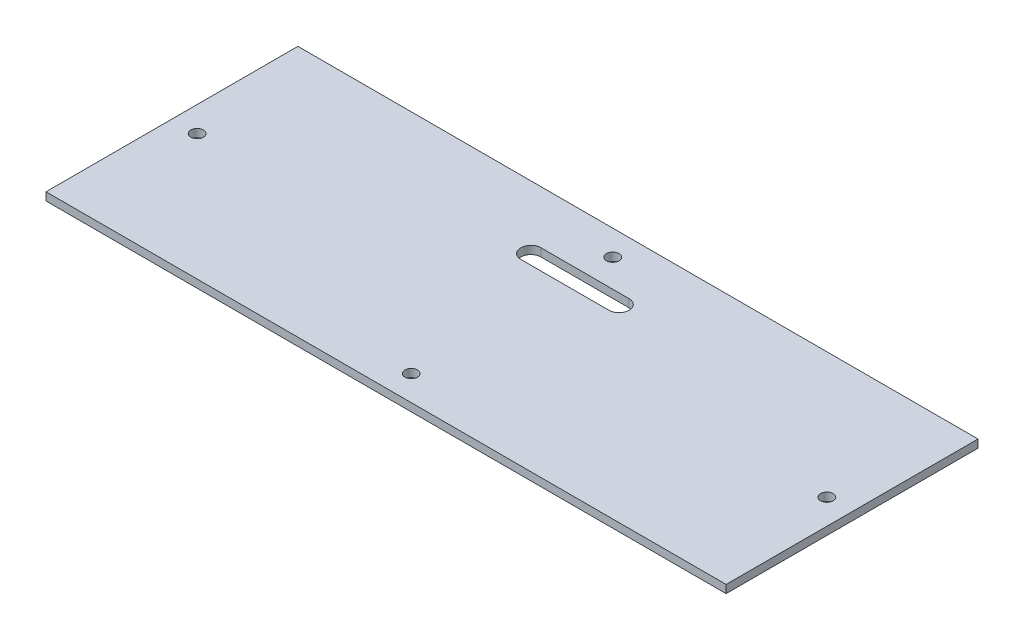
ISO-10303-21;
HEADER;
FILE_DESCRIPTION(('STEP AP214'),'2;1');
FILE_NAME('part.step','',(''),(''),'','','');
FILE_SCHEMA(('AUTOMOTIVE_DESIGN { 1 0 10303 214 1 1 1 1 }'));
ENDSEC;
DATA;
#1=APPLICATION_CONTEXT('core data for automotive mechanical design processes');
#2=APPLICATION_PROTOCOL_DEFINITION('international standard','automotive_design',2000,#1);
#3=PRODUCT_CONTEXT('',#1,'mechanical');
#4=PRODUCT('Part','Part','',(#3));
#5=PRODUCT_RELATED_PRODUCT_CATEGORY('part','',(#4));
#6=PRODUCT_DEFINITION_FORMATION('','',#4);
#7=PRODUCT_DEFINITION_CONTEXT('part definition',#1,'design');
#8=PRODUCT_DEFINITION('design','',#6,#7);
#9=PRODUCT_DEFINITION_SHAPE('','',#8);
#10=(LENGTH_UNIT() NAMED_UNIT(*) SI_UNIT(.MILLI.,.METRE.));
#11=(NAMED_UNIT(*) PLANE_ANGLE_UNIT() SI_UNIT($,.RADIAN.));
#12=(NAMED_UNIT(*) SI_UNIT($,.STERADIAN.) SOLID_ANGLE_UNIT());
#13=UNCERTAINTY_MEASURE_WITH_UNIT(LENGTH_MEASURE(1.E-05),#10,'distance_accuracy_value','');
#14=(GEOMETRIC_REPRESENTATION_CONTEXT(3) GLOBAL_UNCERTAINTY_ASSIGNED_CONTEXT((#13)) GLOBAL_UNIT_ASSIGNED_CONTEXT((#10,
#11,#12)) REPRESENTATION_CONTEXT('',''));
#15=CARTESIAN_POINT('',(0.,0.,0.));
#16=DIRECTION('',(0.,0.,1.));
#17=DIRECTION('',(1.,0.,0.));
#18=AXIS2_PLACEMENT_3D('',#15,#16,#17);
#19=CARTESIAN_POINT('',(0.,3.175,0.));
#20=DIRECTION('',(1.,0.,0.));
#21=DIRECTION('',(0.,0.,-1.));
#22=AXIS2_PLACEMENT_3D('',#19,#20,#21);
#23=PLANE('',#22);
#24=DIRECTION('',(0.,0.,1.));
#25=VECTOR('',#24,1.);
#26=CARTESIAN_POINT('',(0.,0.,0.));
#27=LINE('',#26,#25);
#28=CARTESIAN_POINT('',(0.,0.,-100.));
#29=VERTEX_POINT('',#28);
#30=CARTESIAN_POINT('',(0.,0.,0.));
#31=VERTEX_POINT('',#30);
#32=EDGE_CURVE('E134',#29,#31,#27,.T.);
#33=ORIENTED_EDGE('',*,*,#32,.T.);
#34=DIRECTION('',(0.,-1.,0.));
#35=VECTOR('',#34,1.);
#36=CARTESIAN_POINT('',(0.,3.175,0.));
#37=LINE('',#36,#35);
#38=CARTESIAN_POINT('',(0.,3.175,0.));
#39=VERTEX_POINT('',#38);
#40=EDGE_CURVE('E11',#39,#31,#37,.T.);
#41=ORIENTED_EDGE('',*,*,#40,.F.);
#42=DIRECTION('',(0.,0.,1.));
#43=VECTOR('',#42,1.);
#44=CARTESIAN_POINT('',(0.,3.175,0.));
#45=LINE('',#44,#43);
#46=CARTESIAN_POINT('',(0.,3.175,-100.));
#47=VERTEX_POINT('',#46);
#48=EDGE_CURVE('E140',#47,#39,#45,.T.);
#49=ORIENTED_EDGE('',*,*,#48,.F.);
#50=DIRECTION('',(0.,-1.,0.));
#51=VECTOR('',#50,1.);
#52=CARTESIAN_POINT('',(0.,3.175,-100.));
#53=LINE('',#52,#51);
#54=EDGE_CURVE('E126',#47,#29,#53,.T.);
#55=ORIENTED_EDGE('',*,*,#54,.T.);
#56=EDGE_LOOP('',(#33,#41,#49,#55));
#57=FACE_BOUND('',#56,.T.);
#58=ADVANCED_FACE('F33',(#57),#23,.F.);
#59=CARTESIAN_POINT('',(0.,3.175,0.));
#60=DIRECTION('',(0.,0.,-1.));
#61=DIRECTION('',(-1.,0.,0.));
#62=AXIS2_PLACEMENT_3D('',#59,#60,#61);
#63=PLANE('',#62);
#64=DIRECTION('',(1.,0.,0.));
#65=VECTOR('',#64,1.);
#66=CARTESIAN_POINT('',(0.,0.,0.));
#67=LINE('',#66,#65);
#68=CARTESIAN_POINT('',(270.,0.,0.));
#69=VERTEX_POINT('',#68);
#70=EDGE_CURVE('E88',#31,#69,#67,.T.);
#71=ORIENTED_EDGE('',*,*,#70,.T.);
#72=DIRECTION('',(0.,-1.,0.));
#73=VECTOR('',#72,1.);
#74=CARTESIAN_POINT('',(270.,3.175,0.));
#75=LINE('',#74,#73);
#76=CARTESIAN_POINT('',(270.,3.175,0.));
#77=VERTEX_POINT('',#76);
#78=EDGE_CURVE('E41',#77,#69,#75,.T.);
#79=ORIENTED_EDGE('',*,*,#78,.F.);
#80=DIRECTION('',(1.,0.,0.));
#81=VECTOR('',#80,1.);
#82=CARTESIAN_POINT('',(0.,3.175,0.));
#83=LINE('',#82,#81);
#84=EDGE_CURVE('E111',#39,#77,#83,.T.);
#85=ORIENTED_EDGE('',*,*,#84,.F.);
#86=ORIENTED_EDGE('',*,*,#40,.T.);
#87=EDGE_LOOP('',(#71,#79,#85,#86));
#88=FACE_BOUND('',#87,.T.);
#89=ADVANCED_FACE('F169',(#88),#63,.F.);
#90=CARTESIAN_POINT('',(270.,3.175,0.));
#91=DIRECTION('',(-1.,0.,0.));
#92=DIRECTION('',(0.,0.,1.));
#93=AXIS2_PLACEMENT_3D('',#90,#91,#92);
#94=PLANE('',#93);
#95=DIRECTION('',(0.,0.,-1.));
#96=VECTOR('',#95,1.);
#97=CARTESIAN_POINT('',(270.,0.,0.));
#98=LINE('',#97,#96);
#99=CARTESIAN_POINT('',(270.,0.,-100.));
#100=VERTEX_POINT('',#99);
#101=EDGE_CURVE('E96',#69,#100,#98,.T.);
#102=ORIENTED_EDGE('',*,*,#101,.T.);
#103=DIRECTION('',(0.,-1.,0.));
#104=VECTOR('',#103,1.);
#105=CARTESIAN_POINT('',(270.,3.175,-100.));
#106=LINE('',#105,#104);
#107=CARTESIAN_POINT('',(270.,3.175,-100.));
#108=VERTEX_POINT('',#107);
#109=EDGE_CURVE('E124',#108,#100,#106,.T.);
#110=ORIENTED_EDGE('',*,*,#109,.F.);
#111=DIRECTION('',(0.,0.,-1.));
#112=VECTOR('',#111,1.);
#113=CARTESIAN_POINT('',(270.,3.175,0.));
#114=LINE('',#113,#112);
#115=EDGE_CURVE('E119',#77,#108,#114,.T.);
#116=ORIENTED_EDGE('',*,*,#115,.F.);
#117=ORIENTED_EDGE('',*,*,#78,.T.);
#118=EDGE_LOOP('',(#102,#110,#116,#117));
#119=FACE_BOUND('',#118,.T.);
#120=ADVANCED_FACE('F125',(#119),#94,.F.);
#121=CARTESIAN_POINT('',(0.,3.175,-100.));
#122=DIRECTION('',(0.,0.,1.));
#123=DIRECTION('',(1.,0.,0.));
#124=AXIS2_PLACEMENT_3D('',#121,#122,#123);
#125=PLANE('',#124);
#126=DIRECTION('',(-1.,0.,0.));
#127=VECTOR('',#126,1.);
#128=CARTESIAN_POINT('',(0.,0.,-100.));
#129=LINE('',#128,#127);
#130=EDGE_CURVE('E103',#100,#29,#129,.T.);
#131=ORIENTED_EDGE('',*,*,#130,.T.);
#132=ORIENTED_EDGE('',*,*,#54,.F.);
#133=DIRECTION('',(-1.,0.,0.));
#134=VECTOR('',#133,1.);
#135=CARTESIAN_POINT('',(0.,3.175,-100.));
#136=LINE('',#135,#134);
#137=EDGE_CURVE('E122',#108,#47,#136,.T.);
#138=ORIENTED_EDGE('',*,*,#137,.F.);
#139=ORIENTED_EDGE('',*,*,#109,.T.);
#140=EDGE_LOOP('',(#131,#132,#138,#139));
#141=FACE_BOUND('',#140,.T.);
#142=ADVANCED_FACE('F128',(#141),#125,.F.);
#143=CARTESIAN_POINT('',(0.,3.175,0.));
#144=DIRECTION('',(0.,-1.,0.));
#145=DIRECTION('',(0.,0.,-1.));
#146=AXIS2_PLACEMENT_3D('',#143,#144,#145);
#147=PLANE('',#146);
#148=CARTESIAN_POINT('',(10.,3.175,-50.));
#149=DIRECTION('',(0.,-1.,0.));
#150=DIRECTION('',(0.,0.,-1.));
#151=AXIS2_PLACEMENT_3D('',#148,#149,#150);
#152=CIRCLE('',#151,2.5);
#153=CARTESIAN_POINT('',(10.,3.175,-52.5));
#154=VERTEX_POINT('',#153);
#155=EDGE_CURVE('E137',#154,#154,#152,.T.);
#156=ORIENTED_EDGE('',*,*,#155,.T.);
#157=EDGE_LOOP('',(#156));
#158=FACE_BOUND('',#157,.T.);
#159=CARTESIAN_POINT('',(260.,3.175,-50.));
#160=DIRECTION('',(0.,-1.,0.));
#161=DIRECTION('',(0.,0.,-1.));
#162=AXIS2_PLACEMENT_3D('',#159,#160,#161);
#163=CIRCLE('',#162,2.50000000000002);
#164=CARTESIAN_POINT('',(260.,3.175,-52.5));
#165=VERTEX_POINT('',#164);
#166=EDGE_CURVE('E157',#165,#165,#163,.T.);
#167=ORIENTED_EDGE('',*,*,#166,.T.);
#168=EDGE_LOOP('',(#167));
#169=FACE_BOUND('',#168,.T.);
#170=CARTESIAN_POINT('',(135.,3.175,-90.));
#171=DIRECTION('',(0.,-1.,0.));
#172=DIRECTION('',(0.,0.,-1.));
#173=AXIS2_PLACEMENT_3D('',#170,#171,#172);
#174=CIRCLE('',#173,2.5);
#175=CARTESIAN_POINT('',(135.,3.175,-92.5));
#176=VERTEX_POINT('',#175);
#177=EDGE_CURVE('E152',#176,#176,#174,.T.);
#178=ORIENTED_EDGE('',*,*,#177,.T.);
#179=EDGE_LOOP('',(#178));
#180=FACE_BOUND('',#179,.T.);
#181=CARTESIAN_POINT('',(135.,3.175,-10.));
#182=DIRECTION('',(0.,-1.,0.));
#183=DIRECTION('',(0.,0.,-1.));
#184=AXIS2_PLACEMENT_3D('',#181,#182,#183);
#185=CIRCLE('',#184,2.5);
#186=CARTESIAN_POINT('',(135.,3.175,-12.5));
#187=VERTEX_POINT('',#186);
#188=EDGE_CURVE('E147',#187,#187,#185,.T.);
#189=ORIENTED_EDGE('',*,*,#188,.T.);
#190=EDGE_LOOP('',(#189));
#191=FACE_BOUND('',#190,.T.);
#192=DIRECTION('',(1.,0.,0.));
#193=VECTOR('',#192,1.);
#194=CARTESIAN_POINT('',(117.5,3.175,-71.));
#195=LINE('',#194,#193);
#196=CARTESIAN_POINT('',(117.5,3.175,-71.));
#197=VERTEX_POINT('',#196);
#198=CARTESIAN_POINT('',(152.5,3.175,-71.));
#199=VERTEX_POINT('',#198);
#200=EDGE_CURVE('E143',#197,#199,#195,.T.);
#201=ORIENTED_EDGE('',*,*,#200,.F.);
#202=CARTESIAN_POINT('',(117.5,3.175,-75.));
#203=DIRECTION('',(0.,1.,0.));
#204=DIRECTION('',(0.,0.,1.));
#205=AXIS2_PLACEMENT_3D('',#202,#203,#204);
#206=CIRCLE('',#205,3.99999999999999);
#207=CARTESIAN_POINT('',(117.5,3.175,-79.));
#208=VERTEX_POINT('',#207);
#209=EDGE_CURVE('E36',#208,#197,#206,.T.);
#210=ORIENTED_EDGE('',*,*,#209,.F.);
#211=DIRECTION('',(-1.,0.,0.));
#212=VECTOR('',#211,1.);
#213=CARTESIAN_POINT('',(117.5,3.175,-79.));
#214=LINE('',#213,#212);
#215=CARTESIAN_POINT('',(152.5,3.175,-79.));
#216=VERTEX_POINT('',#215);
#217=EDGE_CURVE('E79',#216,#208,#214,.T.);
#218=ORIENTED_EDGE('',*,*,#217,.F.);
#219=CARTESIAN_POINT('',(152.5,3.175,-75.));
#220=DIRECTION('',(0.,1.,0.));
#221=DIRECTION('',(0.,0.,1.));
#222=AXIS2_PLACEMENT_3D('',#219,#220,#221);
#223=CIRCLE('',#222,3.99999999999999);
#224=EDGE_CURVE('E145',#199,#216,#223,.T.);
#225=ORIENTED_EDGE('',*,*,#224,.F.);
#226=EDGE_LOOP('',(#201,#210,#218,#225));
#227=FACE_BOUND('',#226,.T.);
#228=ORIENTED_EDGE('',*,*,#48,.T.);
#229=ORIENTED_EDGE('',*,*,#84,.T.);
#230=ORIENTED_EDGE('',*,*,#115,.T.);
#231=ORIENTED_EDGE('',*,*,#137,.T.);
#232=EDGE_LOOP('',(#228,#229,#230,#231));
#233=FACE_BOUND('',#232,.T.);
#234=ADVANCED_FACE('F120',(#158,#169,#180,#191,#227,#233),#147,.F.);
#235=CARTESIAN_POINT('',(0.,0.,0.));
#236=DIRECTION('',(0.,-1.,0.));
#237=DIRECTION('',(0.,0.,-1.));
#238=AXIS2_PLACEMENT_3D('',#235,#236,#237);
#239=PLANE('',#238);
#240=CARTESIAN_POINT('',(10.,0.,-50.));
#241=DIRECTION('',(0.,1.,0.));
#242=DIRECTION('',(0.,0.,1.));
#243=AXIS2_PLACEMENT_3D('',#240,#241,#242);
#244=CIRCLE('',#243,2.5);
#245=CARTESIAN_POINT('',(10.,0.,-47.5));
#246=VERTEX_POINT('',#245);
#247=EDGE_CURVE('E146',#246,#246,#244,.T.);
#248=ORIENTED_EDGE('',*,*,#247,.T.);
#249=EDGE_LOOP('',(#248));
#250=FACE_BOUND('',#249,.T.);
#251=CARTESIAN_POINT('',(260.,0.,-50.));
#252=DIRECTION('',(0.,1.,0.));
#253=DIRECTION('',(0.,0.,1.));
#254=AXIS2_PLACEMENT_3D('',#251,#252,#253);
#255=CIRCLE('',#254,2.50000000000002);
#256=CARTESIAN_POINT('',(260.,0.,-47.5));
#257=VERTEX_POINT('',#256);
#258=EDGE_CURVE('E313',#257,#257,#255,.T.);
#259=ORIENTED_EDGE('',*,*,#258,.T.);
#260=EDGE_LOOP('',(#259));
#261=FACE_BOUND('',#260,.T.);
#262=CARTESIAN_POINT('',(135.,0.,-90.));
#263=DIRECTION('',(0.,1.,0.));
#264=DIRECTION('',(0.,0.,1.));
#265=AXIS2_PLACEMENT_3D('',#262,#263,#264);
#266=CIRCLE('',#265,2.5);
#267=CARTESIAN_POINT('',(135.,0.,-87.5));
#268=VERTEX_POINT('',#267);
#269=EDGE_CURVE('E310',#268,#268,#266,.T.);
#270=ORIENTED_EDGE('',*,*,#269,.T.);
#271=EDGE_LOOP('',(#270));
#272=FACE_BOUND('',#271,.T.);
#273=CARTESIAN_POINT('',(135.,0.,-10.));
#274=DIRECTION('',(0.,1.,0.));
#275=DIRECTION('',(0.,0.,1.));
#276=AXIS2_PLACEMENT_3D('',#273,#274,#275);
#277=CIRCLE('',#276,2.5);
#278=CARTESIAN_POINT('',(135.,0.,-7.50000000000001));
#279=VERTEX_POINT('',#278);
#280=EDGE_CURVE('E300',#279,#279,#277,.T.);
#281=ORIENTED_EDGE('',*,*,#280,.T.);
#282=EDGE_LOOP('',(#281));
#283=FACE_BOUND('',#282,.T.);
#284=CARTESIAN_POINT('',(117.5,0.,-75.));
#285=DIRECTION('',(0.,1.,0.));
#286=DIRECTION('',(0.,0.,1.));
#287=AXIS2_PLACEMENT_3D('',#284,#285,#286);
#288=CIRCLE('',#287,3.99999999999999);
#289=CARTESIAN_POINT('',(117.5,0.,-79.));
#290=VERTEX_POINT('',#289);
#291=CARTESIAN_POINT('',(117.5,0.,-71.));
#292=VERTEX_POINT('',#291);
#293=EDGE_CURVE('E305',#290,#292,#288,.T.);
#294=ORIENTED_EDGE('',*,*,#293,.T.);
#295=DIRECTION('',(1.,0.,0.));
#296=VECTOR('',#295,1.);
#297=CARTESIAN_POINT('',(117.5,0.,-71.));
#298=LINE('',#297,#296);
#299=CARTESIAN_POINT('',(152.5,0.,-71.));
#300=VERTEX_POINT('',#299);
#301=EDGE_CURVE('E303',#292,#300,#298,.T.);
#302=ORIENTED_EDGE('',*,*,#301,.T.);
#303=CARTESIAN_POINT('',(152.5,0.,-75.));
#304=DIRECTION('',(0.,1.,0.));
#305=DIRECTION('',(0.,0.,1.));
#306=AXIS2_PLACEMENT_3D('',#303,#304,#305);
#307=CIRCLE('',#306,3.99999999999999);
#308=CARTESIAN_POINT('',(152.5,0.,-79.));
#309=VERTEX_POINT('',#308);
#310=EDGE_CURVE('E58',#300,#309,#307,.T.);
#311=ORIENTED_EDGE('',*,*,#310,.T.);
#312=DIRECTION('',(-1.,0.,0.));
#313=VECTOR('',#312,1.);
#314=CARTESIAN_POINT('',(117.5,0.,-79.));
#315=LINE('',#314,#313);
#316=EDGE_CURVE('E296',#309,#290,#315,.T.);
#317=ORIENTED_EDGE('',*,*,#316,.T.);
#318=EDGE_LOOP('',(#294,#302,#311,#317));
#319=FACE_BOUND('',#318,.T.);
#320=ORIENTED_EDGE('',*,*,#32,.F.);
#321=ORIENTED_EDGE('',*,*,#130,.F.);
#322=ORIENTED_EDGE('',*,*,#101,.F.);
#323=ORIENTED_EDGE('',*,*,#70,.F.);
#324=EDGE_LOOP('',(#320,#321,#322,#323));
#325=FACE_BOUND('',#324,.T.);
#326=ADVANCED_FACE('F170',(#250,#261,#272,#283,#319,#325),#239,.T.);
#327=CARTESIAN_POINT('',(117.5,0.,-75.));
#328=DIRECTION('',(0.,1.,0.));
#329=DIRECTION('',(0.,0.,1.));
#330=AXIS2_PLACEMENT_3D('',#327,#328,#329);
#331=CYLINDRICAL_SURFACE('',#330,3.99999999999999);
#332=DIRECTION('',(0.,1.,0.));
#333=VECTOR('',#332,1.);
#334=CARTESIAN_POINT('',(117.5,0.,-71.));
#335=LINE('',#334,#333);
#336=EDGE_CURVE('E49',#292,#197,#335,.T.);
#337=ORIENTED_EDGE('',*,*,#336,.F.);
#338=ORIENTED_EDGE('',*,*,#293,.F.);
#339=DIRECTION('',(0.,1.,0.));
#340=VECTOR('',#339,1.);
#341=CARTESIAN_POINT('',(117.5,0.,-79.));
#342=LINE('',#341,#340);
#343=EDGE_CURVE('E294',#290,#208,#342,.T.);
#344=ORIENTED_EDGE('',*,*,#343,.T.);
#345=ORIENTED_EDGE('',*,*,#209,.T.);
#346=EDGE_LOOP('',(#337,#338,#344,#345));
#347=FACE_BOUND('',#346,.T.);
#348=ADVANCED_FACE('F172',(#347),#331,.F.);
#349=CARTESIAN_POINT('',(117.5,0.,-79.));
#350=DIRECTION('',(0.,0.,-1.));
#351=DIRECTION('',(-1.,0.,0.));
#352=AXIS2_PLACEMENT_3D('',#349,#350,#351);
#353=PLANE('',#352);
#354=ORIENTED_EDGE('',*,*,#343,.F.);
#355=ORIENTED_EDGE('',*,*,#316,.F.);
#356=DIRECTION('',(0.,1.,0.));
#357=VECTOR('',#356,1.);
#358=CARTESIAN_POINT('',(152.5,0.,-79.));
#359=LINE('',#358,#357);
#360=EDGE_CURVE('E293',#309,#216,#359,.T.);
#361=ORIENTED_EDGE('',*,*,#360,.T.);
#362=ORIENTED_EDGE('',*,*,#217,.T.);
#363=EDGE_LOOP('',(#354,#355,#361,#362));
#364=FACE_BOUND('',#363,.T.);
#365=ADVANCED_FACE('F179',(#364),#353,.F.);
#366=CARTESIAN_POINT('',(152.5,0.,-75.));
#367=DIRECTION('',(0.,1.,0.));
#368=DIRECTION('',(0.,0.,1.));
#369=AXIS2_PLACEMENT_3D('',#366,#367,#368);
#370=CYLINDRICAL_SURFACE('',#369,3.99999999999999);
#371=ORIENTED_EDGE('',*,*,#360,.F.);
#372=ORIENTED_EDGE('',*,*,#310,.F.);
#373=DIRECTION('',(0.,1.,0.));
#374=VECTOR('',#373,1.);
#375=CARTESIAN_POINT('',(152.5,0.,-71.));
#376=LINE('',#375,#374);
#377=EDGE_CURVE('E160',#300,#199,#376,.T.);
#378=ORIENTED_EDGE('',*,*,#377,.T.);
#379=ORIENTED_EDGE('',*,*,#224,.T.);
#380=EDGE_LOOP('',(#371,#372,#378,#379));
#381=FACE_BOUND('',#380,.T.);
#382=ADVANCED_FACE('F222',(#381),#370,.F.);
#383=CARTESIAN_POINT('',(117.5,0.,-71.));
#384=DIRECTION('',(0.,0.,1.));
#385=DIRECTION('',(1.,0.,0.));
#386=AXIS2_PLACEMENT_3D('',#383,#384,#385);
#387=PLANE('',#386);
#388=ORIENTED_EDGE('',*,*,#377,.F.);
#389=ORIENTED_EDGE('',*,*,#301,.F.);
#390=ORIENTED_EDGE('',*,*,#336,.T.);
#391=ORIENTED_EDGE('',*,*,#200,.T.);
#392=EDGE_LOOP('',(#388,#389,#390,#391));
#393=FACE_BOUND('',#392,.T.);
#394=ADVANCED_FACE('F231',(#393),#387,.F.);
#395=CARTESIAN_POINT('',(135.,0.,-10.));
#396=DIRECTION('',(0.,1.,0.));
#397=DIRECTION('',(0.,0.,1.));
#398=AXIS2_PLACEMENT_3D('',#395,#396,#397);
#399=CYLINDRICAL_SURFACE('',#398,2.5);
#400=ORIENTED_EDGE('',*,*,#280,.F.);
#401=EDGE_LOOP('',(#400));
#402=FACE_BOUND('',#401,.T.);
#403=ORIENTED_EDGE('',*,*,#188,.F.);
#404=EDGE_LOOP('',(#403));
#405=FACE_BOUND('',#404,.T.);
#406=ADVANCED_FACE('F240',(#402,#405),#399,.F.);
#407=CARTESIAN_POINT('',(135.,0.,-90.));
#408=DIRECTION('',(0.,1.,0.));
#409=DIRECTION('',(0.,0.,1.));
#410=AXIS2_PLACEMENT_3D('',#407,#408,#409);
#411=CYLINDRICAL_SURFACE('',#410,2.5);
#412=ORIENTED_EDGE('',*,*,#269,.F.);
#413=EDGE_LOOP('',(#412));
#414=FACE_BOUND('',#413,.T.);
#415=ORIENTED_EDGE('',*,*,#177,.F.);
#416=EDGE_LOOP('',(#415));
#417=FACE_BOUND('',#416,.T.);
#418=ADVANCED_FACE('F249',(#414,#417),#411,.F.);
#419=CARTESIAN_POINT('',(260.,0.,-50.));
#420=DIRECTION('',(0.,1.,0.));
#421=DIRECTION('',(0.,0.,1.));
#422=AXIS2_PLACEMENT_3D('',#419,#420,#421);
#423=CYLINDRICAL_SURFACE('',#422,2.50000000000002);
#424=ORIENTED_EDGE('',*,*,#258,.F.);
#425=EDGE_LOOP('',(#424));
#426=FACE_BOUND('',#425,.T.);
#427=ORIENTED_EDGE('',*,*,#166,.F.);
#428=EDGE_LOOP('',(#427));
#429=FACE_BOUND('',#428,.T.);
#430=ADVANCED_FACE('F259',(#426,#429),#423,.F.);
#431=CARTESIAN_POINT('',(10.,0.,-50.));
#432=DIRECTION('',(0.,1.,0.));
#433=DIRECTION('',(0.,0.,1.));
#434=AXIS2_PLACEMENT_3D('',#431,#432,#433);
#435=CYLINDRICAL_SURFACE('',#434,2.5);
#436=ORIENTED_EDGE('',*,*,#247,.F.);
#437=EDGE_LOOP('',(#436));
#438=FACE_BOUND('',#437,.T.);
#439=ORIENTED_EDGE('',*,*,#155,.F.);
#440=EDGE_LOOP('',(#439));
#441=FACE_BOUND('',#440,.T.);
#442=ADVANCED_FACE('F269',(#438,#441),#435,.F.);
#443=CLOSED_SHELL('',(#58,#89,#120,#142,#234,#326,#348,#365,#382,#394,#406,#418,#430,#442));
#444=MANIFOLD_SOLID_BREP('B2',#443);
#445=ADVANCED_BREP_SHAPE_REPRESENTATION('',(#18,#444),#14);
#446=SHAPE_DEFINITION_REPRESENTATION(#9,#445);
ENDSEC;
END-ISO-10303-21;
